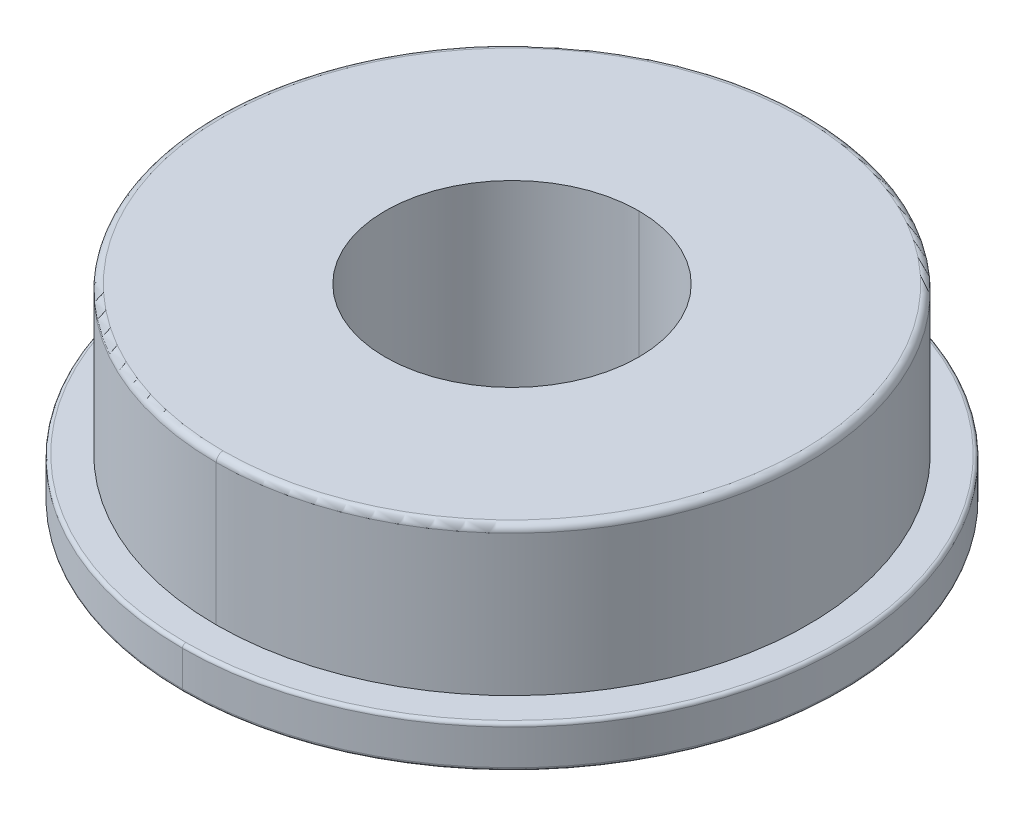
ISO-10303-21;
HEADER;
FILE_DESCRIPTION(('STEP AP214'),'2;1');
FILE_NAME('part.step','',(''),(''),'','','');
FILE_SCHEMA(('AUTOMOTIVE_DESIGN { 1 0 10303 214 1 1 1 1 }'));
ENDSEC;
DATA;
#1=APPLICATION_CONTEXT('core data for automotive mechanical design processes');
#2=APPLICATION_PROTOCOL_DEFINITION('international standard','automotive_design',2000,#1);
#3=PRODUCT_CONTEXT('',#1,'mechanical');
#4=PRODUCT('Part','Part','',(#3));
#5=PRODUCT_RELATED_PRODUCT_CATEGORY('part','',(#4));
#6=PRODUCT_DEFINITION_FORMATION('','',#4);
#7=PRODUCT_DEFINITION_CONTEXT('part definition',#1,'design');
#8=PRODUCT_DEFINITION('design','',#6,#7);
#9=PRODUCT_DEFINITION_SHAPE('','',#8);
#10=(LENGTH_UNIT() NAMED_UNIT(*) SI_UNIT(.MILLI.,.METRE.));
#11=(NAMED_UNIT(*) PLANE_ANGLE_UNIT() SI_UNIT($,.RADIAN.));
#12=(NAMED_UNIT(*) SI_UNIT($,.STERADIAN.) SOLID_ANGLE_UNIT());
#13=UNCERTAINTY_MEASURE_WITH_UNIT(LENGTH_MEASURE(1.E-05),#10,'distance_accuracy_value','');
#14=(GEOMETRIC_REPRESENTATION_CONTEXT(3) GLOBAL_UNCERTAINTY_ASSIGNED_CONTEXT((#13)) GLOBAL_UNIT_ASSIGNED_CONTEXT((#10,
#11,#12)) REPRESENTATION_CONTEXT('',''));
#15=CARTESIAN_POINT('',(0.,0.,0.));
#16=DIRECTION('',(0.,0.,1.));
#17=DIRECTION('',(1.,0.,0.));
#18=AXIS2_PLACEMENT_3D('',#15,#16,#17);
#19=CARTESIAN_POINT('',(0.,7.11325000112419,0.));
#20=DIRECTION('',(0.,-1.,0.));
#21=DIRECTION('',(0.,0.,-1.));
#22=AXIS2_PLACEMENT_3D('',#19,#20,#21);
#23=CYLINDRICAL_SURFACE('',#22,12.3825);
#24=DIRECTION('',(0.,-1.,0.));
#25=VECTOR('',#24,1.);
#26=CARTESIAN_POINT('',(0.,7.11325000112419,12.3825));
#27=LINE('',#26,#25);
#28=CARTESIAN_POINT('',(0.,1.4478,12.3825));
#29=VERTEX_POINT('',#28);
#30=CARTESIAN_POINT('',(0.,0.127,12.3825));
#31=VERTEX_POINT('',#30);
#32=EDGE_CURVE('E118',#29,#31,#27,.T.);
#33=ORIENTED_EDGE('',*,*,#32,.F.);
#34=CARTESIAN_POINT('',(0.,1.4478,0.));
#35=DIRECTION('',(0.,-1.,0.));
#36=DIRECTION('',(0.,0.,-1.));
#37=AXIS2_PLACEMENT_3D('',#34,#35,#36);
#38=CIRCLE('',#37,12.3825);
#39=CARTESIAN_POINT('',(0.,1.4478,-12.3825));
#40=VERTEX_POINT('',#39);
#41=EDGE_CURVE('E113',#29,#40,#38,.T.);
#42=ORIENTED_EDGE('',*,*,#41,.T.);
#43=DIRECTION('',(0.,-1.,0.));
#44=VECTOR('',#43,1.);
#45=CARTESIAN_POINT('',(0.,7.11325000112419,-12.3825));
#46=LINE('',#45,#44);
#47=CARTESIAN_POINT('',(0.,0.127,-12.3825));
#48=VERTEX_POINT('',#47);
#49=EDGE_CURVE('E115',#40,#48,#46,.T.);
#50=ORIENTED_EDGE('',*,*,#49,.T.);
#51=CARTESIAN_POINT('',(0.,0.127,0.));
#52=DIRECTION('',(0.,-1.,0.));
#53=DIRECTION('',(0.,0.,-1.));
#54=AXIS2_PLACEMENT_3D('',#51,#52,#53);
#55=CIRCLE('',#54,12.3825);
#56=EDGE_CURVE('E11',#31,#48,#55,.T.);
#57=ORIENTED_EDGE('',*,*,#56,.F.);
#58=EDGE_LOOP('',(#33,#42,#50,#57));
#59=FACE_BOUND('',#58,.T.);
#60=ADVANCED_FACE('F16',(#59),#23,.T.);
#61=CARTESIAN_POINT('',(0.,0.127,0.));
#62=DIRECTION('',(0.,-1.,0.));
#63=DIRECTION('',(0.,0.,-1.));
#64=AXIS2_PLACEMENT_3D('',#61,#62,#63);
#65=TOROIDAL_SURFACE('',#64,12.2555,0.127);
#66=CARTESIAN_POINT('',(0.,0.127,12.2555));
#67=DIRECTION('',(1.,0.,0.));
#68=DIRECTION('',(0.,0.,-1.));
#69=AXIS2_PLACEMENT_3D('',#66,#67,#68);
#70=CIRCLE('',#69,0.127);
#71=CARTESIAN_POINT('',(0.,0.,12.2555));
#72=VERTEX_POINT('',#71);
#73=EDGE_CURVE('E138',#31,#72,#70,.T.);
#74=ORIENTED_EDGE('',*,*,#73,.F.);
#75=ORIENTED_EDGE('',*,*,#56,.T.);
#76=CARTESIAN_POINT('',(0.,0.127,-12.2555));
#77=DIRECTION('',(-1.,0.,0.));
#78=DIRECTION('',(0.,0.,1.));
#79=AXIS2_PLACEMENT_3D('',#76,#77,#78);
#80=CIRCLE('',#79,0.127);
#81=CARTESIAN_POINT('',(0.,0.,-12.2555));
#82=VERTEX_POINT('',#81);
#83=EDGE_CURVE('E165',#48,#82,#80,.T.);
#84=ORIENTED_EDGE('',*,*,#83,.T.);
#85=CARTESIAN_POINT('',(0.,0.,0.));
#86=DIRECTION('',(0.,-1.,0.));
#87=DIRECTION('',(0.,0.,-1.));
#88=AXIS2_PLACEMENT_3D('',#85,#86,#87);
#89=CIRCLE('',#88,12.2555);
#90=EDGE_CURVE('E25',#72,#82,#89,.T.);
#91=ORIENTED_EDGE('',*,*,#90,.F.);
#92=EDGE_LOOP('',(#74,#75,#84,#91));
#93=FACE_BOUND('',#92,.T.);
#94=ADVANCED_FACE('F18',(#93),#65,.T.);
#95=CARTESIAN_POINT('',(4.7625,0.,0.));
#96=DIRECTION('',(0.,-1.,0.));
#97=DIRECTION('',(0.,0.,-1.));
#98=AXIS2_PLACEMENT_3D('',#95,#96,#97);
#99=PLANE('',#98);
#100=CARTESIAN_POINT('',(0.,0.,0.));
#101=DIRECTION('',(0.,-1.,0.));
#102=DIRECTION('',(0.,0.,-1.));
#103=AXIS2_PLACEMENT_3D('',#100,#101,#102);
#104=CIRCLE('',#103,4.7625);
#105=CARTESIAN_POINT('',(0.,0.,-4.7625));
#106=VERTEX_POINT('',#105);
#107=CARTESIAN_POINT('',(0.,0.,4.7625));
#108=VERTEX_POINT('',#107);
#109=EDGE_CURVE('E224',#106,#108,#104,.T.);
#110=ORIENTED_EDGE('',*,*,#109,.F.);
#111=CARTESIAN_POINT('',(0.,0.,0.));
#112=DIRECTION('',(0.,-1.,0.));
#113=DIRECTION('',(0.,0.,-1.));
#114=AXIS2_PLACEMENT_3D('',#111,#112,#113);
#115=CIRCLE('',#114,4.7625);
#116=EDGE_CURVE('E154',#108,#106,#115,.T.);
#117=ORIENTED_EDGE('',*,*,#116,.F.);
#118=EDGE_LOOP('',(#110,#117));
#119=FACE_BOUND('',#118,.T.);
#120=CARTESIAN_POINT('',(0.,0.,0.));
#121=DIRECTION('',(0.,-1.,0.));
#122=DIRECTION('',(0.,0.,-1.));
#123=AXIS2_PLACEMENT_3D('',#120,#121,#122);
#124=CIRCLE('',#123,12.2555);
#125=EDGE_CURVE('E162',#82,#72,#124,.T.);
#126=ORIENTED_EDGE('',*,*,#125,.T.);
#127=ORIENTED_EDGE('',*,*,#90,.T.);
#128=EDGE_LOOP('',(#126,#127));
#129=FACE_BOUND('',#128,.T.);
#130=ADVANCED_FACE('F230',(#119,#129),#99,.T.);
#131=CARTESIAN_POINT('',(0.,7.11325000112419,0.));
#132=DIRECTION('',(0.,-1.,0.));
#133=DIRECTION('',(0.,0.,-1.));
#134=AXIS2_PLACEMENT_3D('',#131,#132,#133);
#135=CYLINDRICAL_SURFACE('',#134,4.7625);
#136=DIRECTION('',(0.,-1.,0.));
#137=VECTOR('',#136,1.);
#138=CARTESIAN_POINT('',(0.,7.11325000112419,4.7625));
#139=LINE('',#138,#137);
#140=CARTESIAN_POINT('',(0.,7.112,4.7625));
#141=VERTEX_POINT('',#140);
#142=EDGE_CURVE('E170',#141,#108,#139,.T.);
#143=ORIENTED_EDGE('',*,*,#142,.F.);
#144=CARTESIAN_POINT('',(0.,7.112,0.));
#145=DIRECTION('',(0.,-1.,0.));
#146=DIRECTION('',(0.,0.,-1.));
#147=AXIS2_PLACEMENT_3D('',#144,#145,#146);
#148=CIRCLE('',#147,4.7625);
#149=CARTESIAN_POINT('',(0.,7.112,-4.7625));
#150=VERTEX_POINT('',#149);
#151=EDGE_CURVE('E158',#150,#141,#148,.T.);
#152=ORIENTED_EDGE('',*,*,#151,.F.);
#153=DIRECTION('',(0.,-1.,0.));
#154=VECTOR('',#153,1.);
#155=CARTESIAN_POINT('',(0.,7.11325000112419,-4.7625));
#156=LINE('',#155,#154);
#157=EDGE_CURVE('E149',#150,#106,#156,.T.);
#158=ORIENTED_EDGE('',*,*,#157,.T.);
#159=ORIENTED_EDGE('',*,*,#109,.T.);
#160=EDGE_LOOP('',(#143,#152,#158,#159));
#161=FACE_BOUND('',#160,.T.);
#162=ADVANCED_FACE('F262',(#161),#135,.F.);
#163=CARTESIAN_POINT('',(10.8585,7.112,0.));
#164=DIRECTION('',(0.,1.,0.));
#165=DIRECTION('',(1.,0.,0.));
#166=AXIS2_PLACEMENT_3D('',#163,#164,#165);
#167=PLANE('',#166);
#168=ORIENTED_EDGE('',*,*,#151,.T.);
#169=CARTESIAN_POINT('',(0.,7.112,0.));
#170=DIRECTION('',(0.,-1.,0.));
#171=DIRECTION('',(0.,0.,-1.));
#172=AXIS2_PLACEMENT_3D('',#169,#170,#171);
#173=CIRCLE('',#172,4.7625);
#174=EDGE_CURVE('E177',#141,#150,#173,.T.);
#175=ORIENTED_EDGE('',*,*,#174,.T.);
#176=EDGE_LOOP('',(#168,#175));
#177=FACE_BOUND('',#176,.T.);
#178=CARTESIAN_POINT('',(0.,7.112,0.));
#179=DIRECTION('',(0.,-1.,0.));
#180=DIRECTION('',(0.,0.,-1.));
#181=AXIS2_PLACEMENT_3D('',#178,#179,#180);
#182=CIRCLE('',#181,10.8585);
#183=CARTESIAN_POINT('',(0.,7.112,-10.8585));
#184=VERTEX_POINT('',#183);
#185=CARTESIAN_POINT('',(0.,7.112,10.8585));
#186=VERTEX_POINT('',#185);
#187=EDGE_CURVE('E153',#184,#186,#182,.T.);
#188=ORIENTED_EDGE('',*,*,#187,.F.);
#189=CARTESIAN_POINT('',(0.,7.112,0.));
#190=DIRECTION('',(0.,-1.,0.));
#191=DIRECTION('',(0.,0.,-1.));
#192=AXIS2_PLACEMENT_3D('',#189,#190,#191);
#193=CIRCLE('',#192,10.8585);
#194=EDGE_CURVE('E155',#186,#184,#193,.T.);
#195=ORIENTED_EDGE('',*,*,#194,.F.);
#196=EDGE_LOOP('',(#188,#195));
#197=FACE_BOUND('',#196,.T.);
#198=ADVANCED_FACE('F259',(#177,#197),#167,.T.);
#199=CARTESIAN_POINT('',(0.,6.858,0.));
#200=DIRECTION('',(0.,-1.,0.));
#201=DIRECTION('',(0.,0.,-1.));
#202=AXIS2_PLACEMENT_3D('',#199,#200,#201);
#203=TOROIDAL_SURFACE('',#202,10.8585,0.254);
#204=CARTESIAN_POINT('',(0.,6.858,10.8585));
#205=DIRECTION('',(1.,0.,0.));
#206=DIRECTION('',(0.,0.,-1.));
#207=AXIS2_PLACEMENT_3D('',#204,#205,#206);
#208=CIRCLE('',#207,0.254);
#209=CARTESIAN_POINT('',(0.,6.858,11.1125));
#210=VERTEX_POINT('',#209);
#211=EDGE_CURVE('E193',#186,#210,#208,.T.);
#212=ORIENTED_EDGE('',*,*,#211,.F.);
#213=ORIENTED_EDGE('',*,*,#194,.T.);
#214=CARTESIAN_POINT('',(0.,6.858,-10.8585));
#215=DIRECTION('',(-1.,0.,0.));
#216=DIRECTION('',(0.,0.,1.));
#217=AXIS2_PLACEMENT_3D('',#214,#215,#216);
#218=CIRCLE('',#217,0.254);
#219=CARTESIAN_POINT('',(0.,6.858,-11.1125));
#220=VERTEX_POINT('',#219);
#221=EDGE_CURVE('E181',#184,#220,#218,.T.);
#222=ORIENTED_EDGE('',*,*,#221,.T.);
#223=CARTESIAN_POINT('',(0.,6.858,0.));
#224=DIRECTION('',(0.,-1.,0.));
#225=DIRECTION('',(0.,0.,-1.));
#226=AXIS2_PLACEMENT_3D('',#223,#224,#225);
#227=CIRCLE('',#226,11.1125);
#228=EDGE_CURVE('E159',#210,#220,#227,.T.);
#229=ORIENTED_EDGE('',*,*,#228,.F.);
#230=EDGE_LOOP('',(#212,#213,#222,#229));
#231=FACE_BOUND('',#230,.T.);
#232=ADVANCED_FACE('F270',(#231),#203,.T.);
#233=CARTESIAN_POINT('',(0.,7.11325000112419,0.));
#234=DIRECTION('',(0.,-1.,0.));
#235=DIRECTION('',(0.,0.,-1.));
#236=AXIS2_PLACEMENT_3D('',#233,#234,#235);
#237=CYLINDRICAL_SURFACE('',#236,11.1125);
#238=DIRECTION('',(0.,-1.,0.));
#239=VECTOR('',#238,1.);
#240=CARTESIAN_POINT('',(0.,7.11325000112419,11.1125));
#241=LINE('',#240,#239);
#242=CARTESIAN_POINT('',(0.,1.5748,11.1125));
#243=VERTEX_POINT('',#242);
#244=EDGE_CURVE('E185',#210,#243,#241,.T.);
#245=ORIENTED_EDGE('',*,*,#244,.F.);
#246=ORIENTED_EDGE('',*,*,#228,.T.);
#247=DIRECTION('',(0.,-1.,0.));
#248=VECTOR('',#247,1.);
#249=CARTESIAN_POINT('',(0.,7.11325000112419,-11.1125));
#250=LINE('',#249,#248);
#251=CARTESIAN_POINT('',(0.,1.5748,-11.1125));
#252=VERTEX_POINT('',#251);
#253=EDGE_CURVE('E207',#220,#252,#250,.T.);
#254=ORIENTED_EDGE('',*,*,#253,.T.);
#255=CARTESIAN_POINT('',(0.,1.5748,0.));
#256=DIRECTION('',(0.,-1.,0.));
#257=DIRECTION('',(0.,0.,-1.));
#258=AXIS2_PLACEMENT_3D('',#255,#256,#257);
#259=CIRCLE('',#258,11.1125);
#260=EDGE_CURVE('E122',#243,#252,#259,.T.);
#261=ORIENTED_EDGE('',*,*,#260,.F.);
#262=EDGE_LOOP('',(#245,#246,#254,#261));
#263=FACE_BOUND('',#262,.T.);
#264=ADVANCED_FACE('F286',(#263),#237,.T.);
#265=CARTESIAN_POINT('',(12.2555,1.5748,0.));
#266=DIRECTION('',(0.,1.,0.));
#267=DIRECTION('',(1.,0.,0.));
#268=AXIS2_PLACEMENT_3D('',#265,#266,#267);
#269=PLANE('',#268);
#270=CARTESIAN_POINT('',(0.,1.5748,0.));
#271=DIRECTION('',(0.,-1.,0.));
#272=DIRECTION('',(0.,0.,-1.));
#273=AXIS2_PLACEMENT_3D('',#270,#271,#272);
#274=CIRCLE('',#273,11.1125);
#275=EDGE_CURVE('E203',#252,#243,#274,.T.);
#276=ORIENTED_EDGE('',*,*,#275,.T.);
#277=ORIENTED_EDGE('',*,*,#260,.T.);
#278=EDGE_LOOP('',(#276,#277));
#279=FACE_BOUND('',#278,.T.);
#280=CARTESIAN_POINT('',(0.,1.5748,0.));
#281=DIRECTION('',(0.,-1.,0.));
#282=DIRECTION('',(0.,0.,-1.));
#283=AXIS2_PLACEMENT_3D('',#280,#281,#282);
#284=CIRCLE('',#283,12.2555);
#285=CARTESIAN_POINT('',(0.,1.5748,-12.2555));
#286=VERTEX_POINT('',#285);
#287=CARTESIAN_POINT('',(0.,1.5748,12.2555));
#288=VERTEX_POINT('',#287);
#289=EDGE_CURVE('E204',#286,#288,#284,.T.);
#290=ORIENTED_EDGE('',*,*,#289,.F.);
#291=CARTESIAN_POINT('',(0.,1.5748,0.));
#292=DIRECTION('',(0.,-1.,0.));
#293=DIRECTION('',(0.,0.,-1.));
#294=AXIS2_PLACEMENT_3D('',#291,#292,#293);
#295=CIRCLE('',#294,12.2555);
#296=EDGE_CURVE('E37',#288,#286,#295,.T.);
#297=ORIENTED_EDGE('',*,*,#296,.F.);
#298=EDGE_LOOP('',(#290,#297));
#299=FACE_BOUND('',#298,.T.);
#300=ADVANCED_FACE('F291',(#279,#299),#269,.T.);
#301=CARTESIAN_POINT('',(0.,1.4478,0.));
#302=DIRECTION('',(0.,-1.,0.));
#303=DIRECTION('',(0.,0.,-1.));
#304=AXIS2_PLACEMENT_3D('',#301,#302,#303);
#305=TOROIDAL_SURFACE('',#304,12.2555,0.127);
#306=CARTESIAN_POINT('',(0.,1.4478,12.2555));
#307=DIRECTION('',(1.,0.,0.));
#308=DIRECTION('',(0.,0.,-1.));
#309=AXIS2_PLACEMENT_3D('',#306,#307,#308);
#310=CIRCLE('',#309,0.127);
#311=EDGE_CURVE('E130',#288,#29,#310,.T.);
#312=ORIENTED_EDGE('',*,*,#311,.F.);
#313=ORIENTED_EDGE('',*,*,#296,.T.);
#314=CARTESIAN_POINT('',(0.,1.4478,-12.2555));
#315=DIRECTION('',(-1.,0.,0.));
#316=DIRECTION('',(0.,0.,1.));
#317=AXIS2_PLACEMENT_3D('',#314,#315,#316);
#318=CIRCLE('',#317,0.127);
#319=EDGE_CURVE('E124',#286,#40,#318,.T.);
#320=ORIENTED_EDGE('',*,*,#319,.T.);
#321=ORIENTED_EDGE('',*,*,#41,.F.);
#322=EDGE_LOOP('',(#312,#313,#320,#321));
#323=FACE_BOUND('',#322,.T.);
#324=ADVANCED_FACE('F125',(#323),#305,.T.);
#325=CARTESIAN_POINT('',(0.,1.4478,0.));
#326=DIRECTION('',(0.,-1.,0.));
#327=DIRECTION('',(0.,0.,-1.));
#328=AXIS2_PLACEMENT_3D('',#325,#326,#327);
#329=TOROIDAL_SURFACE('',#328,12.2555,0.127);
#330=ORIENTED_EDGE('',*,*,#289,.T.);
#331=ORIENTED_EDGE('',*,*,#311,.T.);
#332=CARTESIAN_POINT('',(0.,1.4478,0.));
#333=DIRECTION('',(0.,-1.,0.));
#334=DIRECTION('',(0.,0.,-1.));
#335=AXIS2_PLACEMENT_3D('',#332,#333,#334);
#336=CIRCLE('',#335,12.3825);
#337=EDGE_CURVE('E134',#40,#29,#336,.T.);
#338=ORIENTED_EDGE('',*,*,#337,.F.);
#339=ORIENTED_EDGE('',*,*,#319,.F.);
#340=EDGE_LOOP('',(#330,#331,#338,#339));
#341=FACE_BOUND('',#340,.T.);
#342=ADVANCED_FACE('F140',(#341),#329,.T.);
#343=CARTESIAN_POINT('',(0.,7.11325000112419,0.));
#344=DIRECTION('',(0.,-1.,0.));
#345=DIRECTION('',(0.,0.,-1.));
#346=AXIS2_PLACEMENT_3D('',#343,#344,#345);
#347=CYLINDRICAL_SURFACE('',#346,11.1125);
#348=CARTESIAN_POINT('',(0.,6.858,0.));
#349=DIRECTION('',(0.,-1.,0.));
#350=DIRECTION('',(0.,0.,-1.));
#351=AXIS2_PLACEMENT_3D('',#348,#349,#350);
#352=CIRCLE('',#351,11.1125);
#353=EDGE_CURVE('E186',#220,#210,#352,.T.);
#354=ORIENTED_EDGE('',*,*,#353,.T.);
#355=ORIENTED_EDGE('',*,*,#244,.T.);
#356=ORIENTED_EDGE('',*,*,#275,.F.);
#357=ORIENTED_EDGE('',*,*,#253,.F.);
#358=EDGE_LOOP('',(#354,#355,#356,#357));
#359=FACE_BOUND('',#358,.T.);
#360=ADVANCED_FACE('F289',(#359),#347,.T.);
#361=CARTESIAN_POINT('',(0.,6.858,0.));
#362=DIRECTION('',(0.,-1.,0.));
#363=DIRECTION('',(0.,0.,-1.));
#364=AXIS2_PLACEMENT_3D('',#361,#362,#363);
#365=TOROIDAL_SURFACE('',#364,10.8585,0.254);
#366=ORIENTED_EDGE('',*,*,#187,.T.);
#367=ORIENTED_EDGE('',*,*,#211,.T.);
#368=ORIENTED_EDGE('',*,*,#353,.F.);
#369=ORIENTED_EDGE('',*,*,#221,.F.);
#370=EDGE_LOOP('',(#366,#367,#368,#369));
#371=FACE_BOUND('',#370,.T.);
#372=ADVANCED_FACE('F247',(#371),#365,.T.);
#373=CARTESIAN_POINT('',(0.,7.11325000112419,0.));
#374=DIRECTION('',(0.,-1.,0.));
#375=DIRECTION('',(0.,0.,-1.));
#376=AXIS2_PLACEMENT_3D('',#373,#374,#375);
#377=CYLINDRICAL_SURFACE('',#376,4.7625);
#378=ORIENTED_EDGE('',*,*,#174,.F.);
#379=ORIENTED_EDGE('',*,*,#142,.T.);
#380=ORIENTED_EDGE('',*,*,#116,.T.);
#381=ORIENTED_EDGE('',*,*,#157,.F.);
#382=EDGE_LOOP('',(#378,#379,#380,#381));
#383=FACE_BOUND('',#382,.T.);
#384=ADVANCED_FACE('F238',(#383),#377,.F.);
#385=CARTESIAN_POINT('',(0.,0.127,0.));
#386=DIRECTION('',(0.,-1.,0.));
#387=DIRECTION('',(0.,0.,-1.));
#388=AXIS2_PLACEMENT_3D('',#385,#386,#387);
#389=TOROIDAL_SURFACE('',#388,12.2555,0.127);
#390=CARTESIAN_POINT('',(0.,0.127,0.));
#391=DIRECTION('',(0.,-1.,0.));
#392=DIRECTION('',(0.,0.,-1.));
#393=AXIS2_PLACEMENT_3D('',#390,#391,#392);
#394=CIRCLE('',#393,12.3825);
#395=EDGE_CURVE('E136',#48,#31,#394,.T.);
#396=ORIENTED_EDGE('',*,*,#395,.T.);
#397=ORIENTED_EDGE('',*,*,#73,.T.);
#398=ORIENTED_EDGE('',*,*,#125,.F.);
#399=ORIENTED_EDGE('',*,*,#83,.F.);
#400=EDGE_LOOP('',(#396,#397,#398,#399));
#401=FACE_BOUND('',#400,.T.);
#402=ADVANCED_FACE('F236',(#401),#389,.T.);
#403=CARTESIAN_POINT('',(0.,7.11325000112419,0.));
#404=DIRECTION('',(0.,-1.,0.));
#405=DIRECTION('',(0.,0.,-1.));
#406=AXIS2_PLACEMENT_3D('',#403,#404,#405);
#407=CYLINDRICAL_SURFACE('',#406,12.3825);
#408=ORIENTED_EDGE('',*,*,#337,.T.);
#409=ORIENTED_EDGE('',*,*,#32,.T.);
#410=ORIENTED_EDGE('',*,*,#395,.F.);
#411=ORIENTED_EDGE('',*,*,#49,.F.);
#412=EDGE_LOOP('',(#408,#409,#410,#411));
#413=FACE_BOUND('',#412,.T.);
#414=ADVANCED_FACE('F133',(#413),#407,.T.);
#415=CLOSED_SHELL('',(#60,#94,#130,#162,#198,#232,#264,#300,#324,#342,#360,#372,#384,#402,#414));
#416=MANIFOLD_SOLID_BREP('B1',#415);
#417=ADVANCED_BREP_SHAPE_REPRESENTATION('',(#18,#416),#14);
#418=SHAPE_DEFINITION_REPRESENTATION(#9,#417);
ENDSEC;
END-ISO-10303-21;
